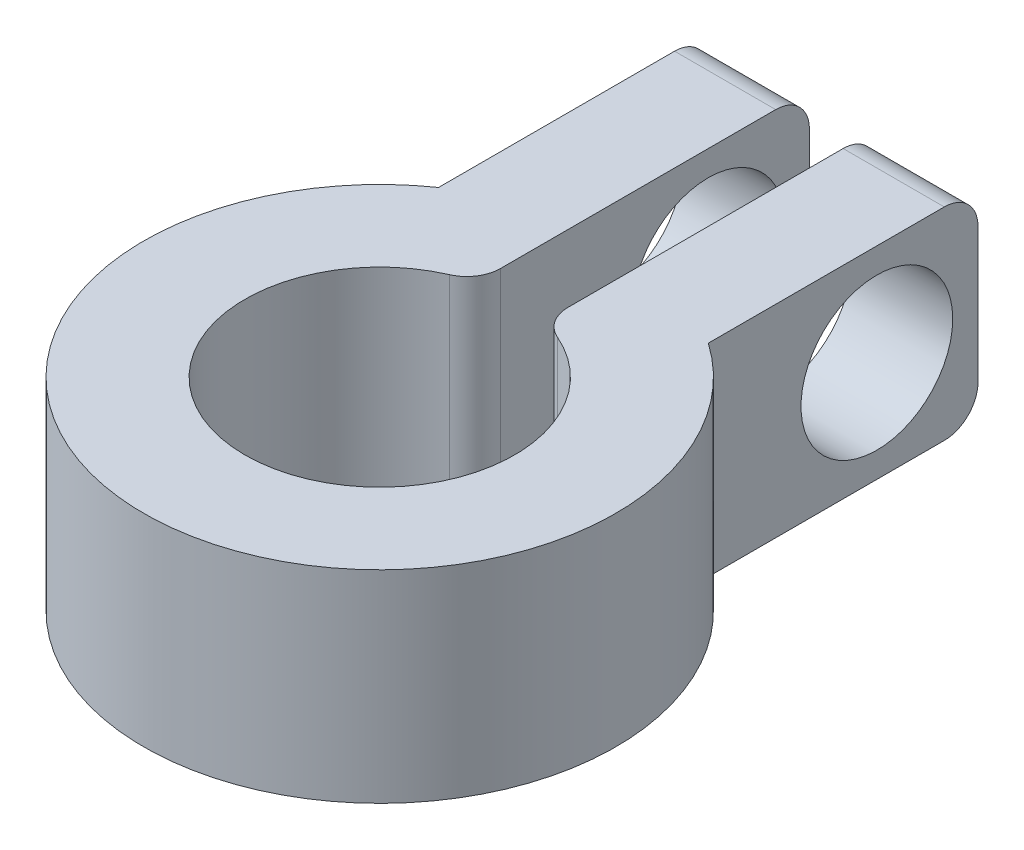
ISO-10303-21;
HEADER;
FILE_DESCRIPTION(('STEP AP214'),'2;1');
FILE_NAME('part.step','',(''),(''),'','','');
FILE_SCHEMA(('AUTOMOTIVE_DESIGN { 1 0 10303 214 1 1 1 1 }'));
ENDSEC;
DATA;
#1=APPLICATION_CONTEXT('core data for automotive mechanical design processes');
#2=APPLICATION_PROTOCOL_DEFINITION('international standard','automotive_design',2000,#1);
#3=PRODUCT_CONTEXT('',#1,'mechanical');
#4=PRODUCT('Part','Part','',(#3));
#5=PRODUCT_RELATED_PRODUCT_CATEGORY('part','',(#4));
#6=PRODUCT_DEFINITION_FORMATION('','',#4);
#7=PRODUCT_DEFINITION_CONTEXT('part definition',#1,'design');
#8=PRODUCT_DEFINITION('design','',#6,#7);
#9=PRODUCT_DEFINITION_SHAPE('','',#8);
#10=(LENGTH_UNIT() NAMED_UNIT(*) SI_UNIT(.MILLI.,.METRE.));
#11=(NAMED_UNIT(*) PLANE_ANGLE_UNIT() SI_UNIT($,.RADIAN.));
#12=(NAMED_UNIT(*) SI_UNIT($,.STERADIAN.) SOLID_ANGLE_UNIT());
#13=UNCERTAINTY_MEASURE_WITH_UNIT(LENGTH_MEASURE(1.E-05),#10,'distance_accuracy_value','');
#14=(GEOMETRIC_REPRESENTATION_CONTEXT(3) GLOBAL_UNCERTAINTY_ASSIGNED_CONTEXT((#13)) GLOBAL_UNIT_ASSIGNED_CONTEXT((#10,
#11,#12)) REPRESENTATION_CONTEXT('',''));
#15=CARTESIAN_POINT('',(0.,0.,0.));
#16=DIRECTION('',(0.,0.,1.));
#17=DIRECTION('',(1.,0.,0.));
#18=AXIS2_PLACEMENT_3D('',#15,#16,#17);
#19=CARTESIAN_POINT('',(0.,6.,0.));
#20=DIRECTION('',(0.,-1.,0.));
#21=DIRECTION('',(0.,0.,-1.));
#22=AXIS2_PLACEMENT_3D('',#19,#20,#21);
#23=CYLINDRICAL_SURFACE('',#22,4.);
#24=CARTESIAN_POINT('',(0.,6.,0.));
#25=DIRECTION('',(0.,-1.,0.));
#26=DIRECTION('',(0.,0.,1.));
#27=AXIS2_PLACEMENT_3D('',#24,#25,#26);
#28=CIRCLE('',#27,4.);
#29=CARTESIAN_POINT('',(1.6,6.,-3.66606055596467));
#30=VERTEX_POINT('',#29);
#31=CARTESIAN_POINT('',(-1.6,6.,-3.66606055596467));
#32=VERTEX_POINT('',#31);
#33=EDGE_CURVE('E190',#30,#32,#28,.T.);
#34=ORIENTED_EDGE('',*,*,#33,.F.);
#35=DIRECTION('',(0.,-1.,0.));
#36=VECTOR('',#35,1.);
#37=CARTESIAN_POINT('',(1.6,6.,-3.66606055596467));
#38=LINE('',#37,#36);
#39=CARTESIAN_POINT('',(1.6,0.,-3.66606055596467));
#40=VERTEX_POINT('',#39);
#41=EDGE_CURVE('E208',#30,#40,#38,.T.);
#42=ORIENTED_EDGE('',*,*,#41,.T.);
#43=CARTESIAN_POINT('',(0.,0.,0.));
#44=DIRECTION('',(0.,-1.,0.));
#45=DIRECTION('',(0.,0.,1.));
#46=AXIS2_PLACEMENT_3D('',#43,#44,#45);
#47=CIRCLE('',#46,4.);
#48=CARTESIAN_POINT('',(-1.6,0.,-3.66606055596467));
#49=VERTEX_POINT('',#48);
#50=EDGE_CURVE('E175',#40,#49,#47,.T.);
#51=ORIENTED_EDGE('',*,*,#50,.T.);
#52=DIRECTION('',(0.,-1.,0.));
#53=VECTOR('',#52,1.);
#54=CARTESIAN_POINT('',(-1.6,6.,-3.66606055596467));
#55=LINE('',#54,#53);
#56=EDGE_CURVE('E201',#49,#32,#55,.F.);
#57=ORIENTED_EDGE('',*,*,#56,.T.);
#58=EDGE_LOOP('',(#34,#42,#51,#57));
#59=FACE_BOUND('',#58,.T.);
#60=ADVANCED_FACE('F39',(#59),#23,.F.);
#61=CARTESIAN_POINT('',(-1.,6.,-3.87298334620742));
#62=DIRECTION('',(-1.,0.,0.));
#63=DIRECTION('',(0.,0.,1.));
#64=AXIS2_PLACEMENT_3D('',#61,#62,#63);
#65=PLANE('',#64);
#66=CARTESIAN_POINT('',(-1.,3.,-10.744562646538));
#67=DIRECTION('',(-1.,0.,0.));
#68=DIRECTION('',(0.,0.,1.));
#69=AXIS2_PLACEMENT_3D('',#66,#67,#68);
#70=CIRCLE('',#69,2.25);
#71=CARTESIAN_POINT('',(-1.,3.,-8.49456264653803));
#72=VERTEX_POINT('',#71);
#73=EDGE_CURVE('E179',#72,#72,#70,.T.);
#74=ORIENTED_EDGE('',*,*,#73,.T.);
#75=EDGE_LOOP('',(#74));
#76=FACE_BOUND('',#75,.T.);
#77=DIRECTION('',(0.,0.,-1.));
#78=VECTOR('',#77,1.);
#79=CARTESIAN_POINT('',(-1.,6.,-3.87298334620742));
#80=LINE('',#79,#78);
#81=CARTESIAN_POINT('',(-1.,6.,-4.58257569495584));
#82=VERTEX_POINT('',#81);
#83=CARTESIAN_POINT('',(-1.,6.,-12.744562646538));
#84=VERTEX_POINT('',#83);
#85=EDGE_CURVE('E152',#82,#84,#80,.T.);
#86=ORIENTED_EDGE('',*,*,#85,.F.);
#87=DIRECTION('',(0.,-1.,0.));
#88=VECTOR('',#87,1.);
#89=CARTESIAN_POINT('',(-1.,6.,-4.58257569495584));
#90=LINE('',#89,#88);
#91=CARTESIAN_POINT('',(-1.,0.,-4.58257569495584));
#92=VERTEX_POINT('',#91);
#93=EDGE_CURVE('E237',#82,#92,#90,.T.);
#94=ORIENTED_EDGE('',*,*,#93,.T.);
#95=DIRECTION('',(0.,0.,-1.));
#96=VECTOR('',#95,1.);
#97=CARTESIAN_POINT('',(-1.,0.,-3.87298334620742));
#98=LINE('',#97,#96);
#99=CARTESIAN_POINT('',(-1.,0.,-12.744562646538));
#100=VERTEX_POINT('',#99);
#101=EDGE_CURVE('E178',#92,#100,#98,.T.);
#102=ORIENTED_EDGE('',*,*,#101,.T.);
#103=CARTESIAN_POINT('',(-1.,1.,-12.744562646538));
#104=DIRECTION('',(-1.,0.,0.));
#105=DIRECTION('',(0.,0.,1.));
#106=AXIS2_PLACEMENT_3D('',#103,#104,#105);
#107=CIRCLE('',#106,1.);
#108=CARTESIAN_POINT('',(-1.,1.,-13.744562646538));
#109=VERTEX_POINT('',#108);
#110=EDGE_CURVE('E233',#100,#109,#107,.F.);
#111=ORIENTED_EDGE('',*,*,#110,.T.);
#112=DIRECTION('',(0.,-1.,0.));
#113=VECTOR('',#112,1.);
#114=CARTESIAN_POINT('',(-1.,6.,-13.744562646538));
#115=LINE('',#114,#113);
#116=CARTESIAN_POINT('',(-1.,5.,-13.744562646538));
#117=VERTEX_POINT('',#116);
#118=EDGE_CURVE('E198',#117,#109,#115,.T.);
#119=ORIENTED_EDGE('',*,*,#118,.F.);
#120=CARTESIAN_POINT('',(-1.,5.,-12.744562646538));
#121=DIRECTION('',(-1.,0.,0.));
#122=DIRECTION('',(0.,0.,1.));
#123=AXIS2_PLACEMENT_3D('',#120,#121,#122);
#124=CIRCLE('',#123,1.);
#125=EDGE_CURVE('E235',#117,#84,#124,.F.);
#126=ORIENTED_EDGE('',*,*,#125,.T.);
#127=EDGE_LOOP('',(#86,#94,#102,#111,#119,#126));
#128=FACE_BOUND('',#127,.T.);
#129=ADVANCED_FACE('F301',(#76,#128),#65,.F.);
#130=CARTESIAN_POINT('',(-1.,6.,-13.744562646538));
#131=DIRECTION('',(0.,0.,1.));
#132=DIRECTION('',(1.,0.,0.));
#133=AXIS2_PLACEMENT_3D('',#130,#131,#132);
#134=PLANE('',#133);
#135=DIRECTION('',(0.,-1.,0.));
#136=VECTOR('',#135,1.);
#137=CARTESIAN_POINT('',(-4.,6.,-13.744562646538));
#138=LINE('',#137,#136);
#139=CARTESIAN_POINT('',(-4.,5.,-13.744562646538));
#140=VERTEX_POINT('',#139);
#141=CARTESIAN_POINT('',(-4.,1.,-13.744562646538));
#142=VERTEX_POINT('',#141);
#143=EDGE_CURVE('E161',#140,#142,#138,.T.);
#144=ORIENTED_EDGE('',*,*,#143,.F.);
#145=DIRECTION('',(-1.,0.,0.));
#146=VECTOR('',#145,1.);
#147=CARTESIAN_POINT('',(-1.,5.,-13.744562646538));
#148=LINE('',#147,#146);
#149=EDGE_CURVE('E247',#140,#117,#148,.F.);
#150=ORIENTED_EDGE('',*,*,#149,.T.);
#151=ORIENTED_EDGE('',*,*,#118,.T.);
#152=DIRECTION('',(-1.,0.,0.));
#153=VECTOR('',#152,1.);
#154=CARTESIAN_POINT('',(-1.,1.,-13.744562646538));
#155=LINE('',#154,#153);
#156=EDGE_CURVE('E244',#109,#142,#155,.T.);
#157=ORIENTED_EDGE('',*,*,#156,.T.);
#158=EDGE_LOOP('',(#144,#150,#151,#157));
#159=FACE_BOUND('',#158,.T.);
#160=ADVANCED_FACE('F307',(#159),#134,.F.);
#161=CARTESIAN_POINT('',(-4.,6.,-13.744562646538));
#162=DIRECTION('',(1.,0.,0.));
#163=DIRECTION('',(0.,0.,-1.));
#164=AXIS2_PLACEMENT_3D('',#161,#162,#163);
#165=PLANE('',#164);
#166=CARTESIAN_POINT('',(-4.,3.,-10.744562646538));
#167=DIRECTION('',(1.,0.,0.));
#168=DIRECTION('',(0.,0.,-1.));
#169=AXIS2_PLACEMENT_3D('',#166,#167,#168);
#170=CIRCLE('',#169,2.25);
#171=CARTESIAN_POINT('',(-4.,3.,-12.994562646538));
#172=VERTEX_POINT('',#171);
#173=EDGE_CURVE('E205',#172,#172,#170,.T.);
#174=ORIENTED_EDGE('',*,*,#173,.T.);
#175=EDGE_LOOP('',(#174));
#176=FACE_BOUND('',#175,.T.);
#177=DIRECTION('',(0.,0.,1.));
#178=VECTOR('',#177,1.);
#179=CARTESIAN_POINT('',(-4.,6.,-13.744562646538));
#180=LINE('',#179,#178);
#181=CARTESIAN_POINT('',(-4.,6.,-12.744562646538));
#182=VERTEX_POINT('',#181);
#183=CARTESIAN_POINT('',(-4.,6.,-5.74456264653803));
#184=VERTEX_POINT('',#183);
#185=EDGE_CURVE('E140',#182,#184,#180,.T.);
#186=ORIENTED_EDGE('',*,*,#185,.F.);
#187=CARTESIAN_POINT('',(-4.,5.,-12.744562646538));
#188=DIRECTION('',(1.,0.,0.));
#189=DIRECTION('',(0.,0.,-1.));
#190=AXIS2_PLACEMENT_3D('',#187,#188,#189);
#191=CIRCLE('',#190,1.);
#192=EDGE_CURVE('E242',#182,#140,#191,.F.);
#193=ORIENTED_EDGE('',*,*,#192,.T.);
#194=ORIENTED_EDGE('',*,*,#143,.T.);
#195=CARTESIAN_POINT('',(-4.,1.,-12.744562646538));
#196=DIRECTION('',(1.,0.,0.));
#197=DIRECTION('',(0.,0.,-1.));
#198=AXIS2_PLACEMENT_3D('',#195,#196,#197);
#199=CIRCLE('',#198,1.);
#200=CARTESIAN_POINT('',(-4.,0.,-12.744562646538));
#201=VERTEX_POINT('',#200);
#202=EDGE_CURVE('E240',#142,#201,#199,.F.);
#203=ORIENTED_EDGE('',*,*,#202,.T.);
#204=DIRECTION('',(0.,0.,1.));
#205=VECTOR('',#204,1.);
#206=CARTESIAN_POINT('',(-4.,0.,-13.744562646538));
#207=LINE('',#206,#205);
#208=CARTESIAN_POINT('',(-4.,0.,-5.74456264653803));
#209=VERTEX_POINT('',#208);
#210=EDGE_CURVE('E158',#201,#209,#207,.T.);
#211=ORIENTED_EDGE('',*,*,#210,.T.);
#212=DIRECTION('',(0.,-1.,0.));
#213=VECTOR('',#212,1.);
#214=CARTESIAN_POINT('',(-4.,6.,-5.74456264653803));
#215=LINE('',#214,#213);
#216=EDGE_CURVE('E155',#184,#209,#215,.T.);
#217=ORIENTED_EDGE('',*,*,#216,.F.);
#218=EDGE_LOOP('',(#186,#193,#194,#203,#211,#217));
#219=FACE_BOUND('',#218,.T.);
#220=ADVANCED_FACE('F156',(#176,#219),#165,.F.);
#221=CARTESIAN_POINT('',(0.,6.,0.));
#222=DIRECTION('',(0.,-1.,0.));
#223=DIRECTION('',(0.,0.,-1.));
#224=AXIS2_PLACEMENT_3D('',#221,#222,#223);
#225=CYLINDRICAL_SURFACE('',#224,7.);
#226=CARTESIAN_POINT('',(0.,0.,0.));
#227=DIRECTION('',(0.,1.,0.));
#228=DIRECTION('',(0.,0.,1.));
#229=AXIS2_PLACEMENT_3D('',#226,#227,#228);
#230=CIRCLE('',#229,7.);
#231=CARTESIAN_POINT('',(4.,0.,-5.74456264653803));
#232=VERTEX_POINT('',#231);
#233=EDGE_CURVE('E183',#209,#232,#230,.T.);
#234=ORIENTED_EDGE('',*,*,#233,.T.);
#235=DIRECTION('',(0.,-1.,0.));
#236=VECTOR('',#235,1.);
#237=CARTESIAN_POINT('',(4.,6.,-5.74456264653803));
#238=LINE('',#237,#236);
#239=CARTESIAN_POINT('',(4.,6.,-5.74456264653803));
#240=VERTEX_POINT('',#239);
#241=EDGE_CURVE('E162',#240,#232,#238,.T.);
#242=ORIENTED_EDGE('',*,*,#241,.F.);
#243=CARTESIAN_POINT('',(0.,6.,0.));
#244=DIRECTION('',(0.,1.,0.));
#245=DIRECTION('',(0.,0.,1.));
#246=AXIS2_PLACEMENT_3D('',#243,#244,#245);
#247=CIRCLE('',#246,7.);
#248=EDGE_CURVE('E146',#184,#240,#247,.T.);
#249=ORIENTED_EDGE('',*,*,#248,.F.);
#250=ORIENTED_EDGE('',*,*,#216,.T.);
#251=EDGE_LOOP('',(#234,#242,#249,#250));
#252=FACE_BOUND('',#251,.T.);
#253=ADVANCED_FACE('F164',(#252),#225,.T.);
#254=CARTESIAN_POINT('',(4.,6.,-13.744562646538));
#255=DIRECTION('',(-1.,0.,0.));
#256=DIRECTION('',(0.,0.,1.));
#257=AXIS2_PLACEMENT_3D('',#254,#255,#256);
#258=PLANE('',#257);
#259=CARTESIAN_POINT('',(4.,3.,-10.744562646538));
#260=DIRECTION('',(1.,0.,0.));
#261=DIRECTION('',(0.,0.,-1.));
#262=AXIS2_PLACEMENT_3D('',#259,#260,#261);
#263=CIRCLE('',#262,2.25);
#264=CARTESIAN_POINT('',(4.,3.,-12.994562646538));
#265=VERTEX_POINT('',#264);
#266=EDGE_CURVE('E206',#265,#265,#263,.T.);
#267=ORIENTED_EDGE('',*,*,#266,.F.);
#268=EDGE_LOOP('',(#267));
#269=FACE_BOUND('',#268,.T.);
#270=DIRECTION('',(0.,0.,-1.));
#271=VECTOR('',#270,1.);
#272=CARTESIAN_POINT('',(4.,0.,-13.744562646538));
#273=LINE('',#272,#271);
#274=CARTESIAN_POINT('',(4.,0.,-12.744562646538));
#275=VERTEX_POINT('',#274);
#276=EDGE_CURVE('E185',#232,#275,#273,.T.);
#277=ORIENTED_EDGE('',*,*,#276,.T.);
#278=CARTESIAN_POINT('',(4.,1.,-12.744562646538));
#279=DIRECTION('',(-1.,0.,0.));
#280=DIRECTION('',(0.,0.,1.));
#281=AXIS2_PLACEMENT_3D('',#278,#279,#280);
#282=CIRCLE('',#281,1.);
#283=CARTESIAN_POINT('',(4.,1.,-13.744562646538));
#284=VERTEX_POINT('',#283);
#285=EDGE_CURVE('E11',#275,#284,#282,.F.);
#286=ORIENTED_EDGE('',*,*,#285,.T.);
#287=DIRECTION('',(0.,-1.,0.));
#288=VECTOR('',#287,1.);
#289=CARTESIAN_POINT('',(4.,6.,-13.744562646538));
#290=LINE('',#289,#288);
#291=CARTESIAN_POINT('',(4.,5.,-13.744562646538));
#292=VERTEX_POINT('',#291);
#293=EDGE_CURVE('E193',#292,#284,#290,.T.);
#294=ORIENTED_EDGE('',*,*,#293,.F.);
#295=CARTESIAN_POINT('',(4.,5.,-12.744562646538));
#296=DIRECTION('',(-1.,0.,0.));
#297=DIRECTION('',(0.,0.,1.));
#298=AXIS2_PLACEMENT_3D('',#295,#296,#297);
#299=CIRCLE('',#298,1.);
#300=CARTESIAN_POINT('',(4.,6.,-12.744562646538));
#301=VERTEX_POINT('',#300);
#302=EDGE_CURVE('E47',#292,#301,#299,.F.);
#303=ORIENTED_EDGE('',*,*,#302,.T.);
#304=DIRECTION('',(0.,0.,-1.));
#305=VECTOR('',#304,1.);
#306=CARTESIAN_POINT('',(4.,6.,-13.744562646538));
#307=LINE('',#306,#305);
#308=EDGE_CURVE('E167',#240,#301,#307,.T.);
#309=ORIENTED_EDGE('',*,*,#308,.F.);
#310=ORIENTED_EDGE('',*,*,#241,.T.);
#311=EDGE_LOOP('',(#277,#286,#294,#303,#309,#310));
#312=FACE_BOUND('',#311,.T.);
#313=ADVANCED_FACE('F253',(#269,#312),#258,.F.);
#314=CARTESIAN_POINT('',(0.999999999999997,6.,-13.744562646538));
#315=DIRECTION('',(0.,0.,1.));
#316=DIRECTION('',(1.,0.,0.));
#317=AXIS2_PLACEMENT_3D('',#314,#315,#316);
#318=PLANE('',#317);
#319=ORIENTED_EDGE('',*,*,#293,.T.);
#320=DIRECTION('',(-1.,0.,0.));
#321=VECTOR('',#320,1.);
#322=CARTESIAN_POINT('',(0.999999999999997,1.,-13.744562646538));
#323=LINE('',#322,#321);
#324=CARTESIAN_POINT('',(0.999999999999997,1.,-13.744562646538));
#325=VERTEX_POINT('',#324);
#326=EDGE_CURVE('E250',#284,#325,#323,.T.);
#327=ORIENTED_EDGE('',*,*,#326,.T.);
#328=DIRECTION('',(0.,-1.,0.));
#329=VECTOR('',#328,1.);
#330=CARTESIAN_POINT('',(0.999999999999997,6.,-13.744562646538));
#331=LINE('',#330,#329);
#332=CARTESIAN_POINT('',(0.999999999999997,5.,-13.744562646538));
#333=VERTEX_POINT('',#332);
#334=EDGE_CURVE('E174',#333,#325,#331,.T.);
#335=ORIENTED_EDGE('',*,*,#334,.F.);
#336=DIRECTION('',(-1.,0.,0.));
#337=VECTOR('',#336,1.);
#338=CARTESIAN_POINT('',(4.,5.,-13.744562646538));
#339=LINE('',#338,#337);
#340=EDGE_CURVE('E59',#333,#292,#339,.F.);
#341=ORIENTED_EDGE('',*,*,#340,.T.);
#342=EDGE_LOOP('',(#319,#327,#335,#341));
#343=FACE_BOUND('',#342,.T.);
#344=ADVANCED_FACE('F259',(#343),#318,.F.);
#345=CARTESIAN_POINT('',(0.999999999999999,6.,-3.87298334620742));
#346=DIRECTION('',(1.,0.,0.));
#347=DIRECTION('',(0.,0.,-1.));
#348=AXIS2_PLACEMENT_3D('',#345,#346,#347);
#349=PLANE('',#348);
#350=CARTESIAN_POINT('',(0.999999999999997,3.,-10.744562646538));
#351=DIRECTION('',(1.,0.,0.));
#352=DIRECTION('',(0.,0.,-1.));
#353=AXIS2_PLACEMENT_3D('',#350,#351,#352);
#354=CIRCLE('',#353,2.25);
#355=CARTESIAN_POINT('',(0.999999999999997,3.,-12.994562646538));
#356=VERTEX_POINT('',#355);
#357=EDGE_CURVE('E202',#356,#356,#354,.T.);
#358=ORIENTED_EDGE('',*,*,#357,.T.);
#359=EDGE_LOOP('',(#358));
#360=FACE_BOUND('',#359,.T.);
#361=DIRECTION('',(0.,0.,1.));
#362=VECTOR('',#361,1.);
#363=CARTESIAN_POINT('',(0.999999999999999,0.,-3.87298334620742));
#364=LINE('',#363,#362);
#365=CARTESIAN_POINT('',(0.999999999999997,0.,-12.744562646538));
#366=VERTEX_POINT('',#365);
#367=CARTESIAN_POINT('',(0.999999999999999,0.,-4.58257569495584));
#368=VERTEX_POINT('',#367);
#369=EDGE_CURVE('E187',#366,#368,#364,.T.);
#370=ORIENTED_EDGE('',*,*,#369,.T.);
#371=DIRECTION('',(0.,-1.,0.));
#372=VECTOR('',#371,1.);
#373=CARTESIAN_POINT('',(0.999999999999999,6.,-4.58257569495584));
#374=LINE('',#373,#372);
#375=CARTESIAN_POINT('',(0.999999999999999,6.,-4.58257569495584));
#376=VERTEX_POINT('',#375);
#377=EDGE_CURVE('E223',#368,#376,#374,.F.);
#378=ORIENTED_EDGE('',*,*,#377,.T.);
#379=DIRECTION('',(0.,0.,1.));
#380=VECTOR('',#379,1.);
#381=CARTESIAN_POINT('',(0.999999999999999,6.,-3.87298334620742));
#382=LINE('',#381,#380);
#383=CARTESIAN_POINT('',(0.999999999999997,6.,-12.744562646538));
#384=VERTEX_POINT('',#383);
#385=EDGE_CURVE('E169',#384,#376,#382,.T.);
#386=ORIENTED_EDGE('',*,*,#385,.F.);
#387=CARTESIAN_POINT('',(0.999999999999997,5.,-12.744562646538));
#388=DIRECTION('',(1.,0.,0.));
#389=DIRECTION('',(0.,0.,-1.));
#390=AXIS2_PLACEMENT_3D('',#387,#388,#389);
#391=CIRCLE('',#390,1.);
#392=EDGE_CURVE('E219',#384,#333,#391,.F.);
#393=ORIENTED_EDGE('',*,*,#392,.T.);
#394=ORIENTED_EDGE('',*,*,#334,.T.);
#395=CARTESIAN_POINT('',(0.999999999999997,1.,-12.744562646538));
#396=DIRECTION('',(1.,0.,0.));
#397=DIRECTION('',(0.,0.,-1.));
#398=AXIS2_PLACEMENT_3D('',#395,#396,#397);
#399=CIRCLE('',#398,1.);
#400=EDGE_CURVE('E221',#325,#366,#399,.F.);
#401=ORIENTED_EDGE('',*,*,#400,.T.);
#402=EDGE_LOOP('',(#370,#378,#386,#393,#394,#401));
#403=FACE_BOUND('',#402,.T.);
#404=ADVANCED_FACE('F258',(#360,#403),#349,.F.);
#405=CARTESIAN_POINT('',(0.,6.,0.));
#406=DIRECTION('',(0.,1.,0.));
#407=DIRECTION('',(0.,0.,1.));
#408=AXIS2_PLACEMENT_3D('',#405,#406,#407);
#409=PLANE('',#408);
#410=ORIENTED_EDGE('',*,*,#385,.T.);
#411=CARTESIAN_POINT('',(2.,6.,-4.58257569495584));
#412=DIRECTION('',(0.,1.,0.));
#413=DIRECTION('',(0.,0.,1.));
#414=AXIS2_PLACEMENT_3D('',#411,#412,#413);
#415=CIRCLE('',#414,1.);
#416=EDGE_CURVE('E231',#376,#30,#415,.T.);
#417=ORIENTED_EDGE('',*,*,#416,.T.);
#418=ORIENTED_EDGE('',*,*,#33,.T.);
#419=CARTESIAN_POINT('',(-2.,6.,-4.58257569495584));
#420=DIRECTION('',(0.,1.,0.));
#421=DIRECTION('',(0.,0.,1.));
#422=AXIS2_PLACEMENT_3D('',#419,#420,#421);
#423=CIRCLE('',#422,1.);
#424=EDGE_CURVE('E229',#32,#82,#423,.T.);
#425=ORIENTED_EDGE('',*,*,#424,.T.);
#426=ORIENTED_EDGE('',*,*,#85,.T.);
#427=DIRECTION('',(-1.,0.,0.));
#428=VECTOR('',#427,1.);
#429=CARTESIAN_POINT('',(-4.,6.,-12.744562646538));
#430=LINE('',#429,#428);
#431=EDGE_CURVE('E150',#84,#182,#430,.T.);
#432=ORIENTED_EDGE('',*,*,#431,.T.);
#433=ORIENTED_EDGE('',*,*,#185,.T.);
#434=ORIENTED_EDGE('',*,*,#248,.T.);
#435=ORIENTED_EDGE('',*,*,#308,.T.);
#436=DIRECTION('',(-1.,0.,0.));
#437=VECTOR('',#436,1.);
#438=CARTESIAN_POINT('',(0.999999999999997,6.,-12.744562646538));
#439=LINE('',#438,#437);
#440=EDGE_CURVE('E225',#301,#384,#439,.T.);
#441=ORIENTED_EDGE('',*,*,#440,.T.);
#442=EDGE_LOOP('',(#410,#417,#418,#425,#426,#432,#433,#434,#435,#441));
#443=FACE_BOUND('',#442,.T.);
#444=ADVANCED_FACE('F143',(#443),#409,.T.);
#445=CARTESIAN_POINT('',(0.,0.,0.));
#446=DIRECTION('',(0.,1.,0.));
#447=DIRECTION('',(0.,0.,1.));
#448=AXIS2_PLACEMENT_3D('',#445,#446,#447);
#449=PLANE('',#448);
#450=ORIENTED_EDGE('',*,*,#50,.F.);
#451=CARTESIAN_POINT('',(2.,0.,-4.58257569495584));
#452=DIRECTION('',(0.,1.,0.));
#453=DIRECTION('',(0.,0.,1.));
#454=AXIS2_PLACEMENT_3D('',#451,#452,#453);
#455=CIRCLE('',#454,1.);
#456=EDGE_CURVE('E217',#40,#368,#455,.F.);
#457=ORIENTED_EDGE('',*,*,#456,.T.);
#458=ORIENTED_EDGE('',*,*,#369,.F.);
#459=DIRECTION('',(-1.,0.,0.));
#460=VECTOR('',#459,1.);
#461=CARTESIAN_POINT('',(0.,0.,-12.744562646538));
#462=LINE('',#461,#460);
#463=EDGE_CURVE('E211',#366,#275,#462,.F.);
#464=ORIENTED_EDGE('',*,*,#463,.T.);
#465=ORIENTED_EDGE('',*,*,#276,.F.);
#466=ORIENTED_EDGE('',*,*,#233,.F.);
#467=ORIENTED_EDGE('',*,*,#210,.F.);
#468=DIRECTION('',(-1.,0.,0.));
#469=VECTOR('',#468,1.);
#470=CARTESIAN_POINT('',(0.,0.,-12.744562646538));
#471=LINE('',#470,#469);
#472=EDGE_CURVE('E213',#201,#100,#471,.F.);
#473=ORIENTED_EDGE('',*,*,#472,.T.);
#474=ORIENTED_EDGE('',*,*,#101,.F.);
#475=CARTESIAN_POINT('',(-2.,0.,-4.58257569495584));
#476=DIRECTION('',(0.,1.,0.));
#477=DIRECTION('',(0.,0.,1.));
#478=AXIS2_PLACEMENT_3D('',#475,#476,#477);
#479=CIRCLE('',#478,1.);
#480=EDGE_CURVE('E215',#92,#49,#479,.F.);
#481=ORIENTED_EDGE('',*,*,#480,.T.);
#482=EDGE_LOOP('',(#450,#457,#458,#464,#465,#466,#467,#473,#474,#481));
#483=FACE_BOUND('',#482,.T.);
#484=ADVANCED_FACE('F268',(#483),#449,.F.);
#485=CARTESIAN_POINT('',(-6.,3.,-10.744562646538));
#486=DIRECTION('',(1.,0.,0.));
#487=DIRECTION('',(0.,0.,-1.));
#488=AXIS2_PLACEMENT_3D('',#485,#486,#487);
#489=CYLINDRICAL_SURFACE('',#488,2.25);
#490=ORIENTED_EDGE('',*,*,#266,.T.);
#491=EDGE_LOOP('',(#490));
#492=FACE_BOUND('',#491,.T.);
#493=ORIENTED_EDGE('',*,*,#357,.F.);
#494=EDGE_LOOP('',(#493));
#495=FACE_BOUND('',#494,.T.);
#496=ADVANCED_FACE('F288',(#492,#495),#489,.F.);
#497=ORIENTED_EDGE('',*,*,#173,.F.);
#498=EDGE_LOOP('',(#497));
#499=FACE_BOUND('',#498,.T.);
#500=ORIENTED_EDGE('',*,*,#73,.F.);
#501=EDGE_LOOP('',(#500));
#502=FACE_BOUND('',#501,.T.);
#503=ADVANCED_FACE('F315',(#499,#502),#489,.F.);
#504=CARTESIAN_POINT('',(2.,6.,-4.58257569495584));
#505=DIRECTION('',(0.,-1.,0.));
#506=DIRECTION('',(0.,0.,-1.));
#507=AXIS2_PLACEMENT_3D('',#504,#505,#506);
#508=CYLINDRICAL_SURFACE('',#507,1.);
#509=ORIENTED_EDGE('',*,*,#416,.F.);
#510=ORIENTED_EDGE('',*,*,#377,.F.);
#511=ORIENTED_EDGE('',*,*,#456,.F.);
#512=ORIENTED_EDGE('',*,*,#41,.F.);
#513=EDGE_LOOP('',(#509,#510,#511,#512));
#514=FACE_BOUND('',#513,.T.);
#515=ADVANCED_FACE('F273',(#514),#508,.T.);
#516=CARTESIAN_POINT('',(-2.,6.,-4.58257569495584));
#517=DIRECTION('',(0.,-1.,0.));
#518=DIRECTION('',(0.,0.,-1.));
#519=AXIS2_PLACEMENT_3D('',#516,#517,#518);
#520=CYLINDRICAL_SURFACE('',#519,1.);
#521=ORIENTED_EDGE('',*,*,#424,.F.);
#522=ORIENTED_EDGE('',*,*,#56,.F.);
#523=ORIENTED_EDGE('',*,*,#480,.F.);
#524=ORIENTED_EDGE('',*,*,#93,.F.);
#525=EDGE_LOOP('',(#521,#522,#523,#524));
#526=FACE_BOUND('',#525,.T.);
#527=ADVANCED_FACE('F314',(#526),#520,.T.);
#528=CARTESIAN_POINT('',(0.,5.,-12.744562646538));
#529=DIRECTION('',(1.,0.,0.));
#530=DIRECTION('',(0.,0.,-1.));
#531=AXIS2_PLACEMENT_3D('',#528,#529,#530);
#532=CYLINDRICAL_SURFACE('',#531,1.);
#533=ORIENTED_EDGE('',*,*,#125,.F.);
#534=ORIENTED_EDGE('',*,*,#149,.F.);
#535=ORIENTED_EDGE('',*,*,#192,.F.);
#536=ORIENTED_EDGE('',*,*,#431,.F.);
#537=EDGE_LOOP('',(#533,#534,#535,#536));
#538=FACE_BOUND('',#537,.T.);
#539=ADVANCED_FACE('F318',(#538),#532,.T.);
#540=CARTESIAN_POINT('',(-1.,1.,-12.744562646538));
#541=DIRECTION('',(-1.,0.,0.));
#542=DIRECTION('',(0.,0.,1.));
#543=AXIS2_PLACEMENT_3D('',#540,#541,#542);
#544=CYLINDRICAL_SURFACE('',#543,1.);
#545=ORIENTED_EDGE('',*,*,#110,.F.);
#546=ORIENTED_EDGE('',*,*,#472,.F.);
#547=ORIENTED_EDGE('',*,*,#202,.F.);
#548=ORIENTED_EDGE('',*,*,#156,.F.);
#549=EDGE_LOOP('',(#545,#546,#547,#548));
#550=FACE_BOUND('',#549,.T.);
#551=ADVANCED_FACE('F322',(#550),#544,.T.);
#552=CARTESIAN_POINT('',(0.999999999999997,1.,-12.744562646538));
#553=DIRECTION('',(-1.,0.,0.));
#554=DIRECTION('',(0.,0.,1.));
#555=AXIS2_PLACEMENT_3D('',#552,#553,#554);
#556=CYLINDRICAL_SURFACE('',#555,1.);
#557=ORIENTED_EDGE('',*,*,#285,.F.);
#558=ORIENTED_EDGE('',*,*,#463,.F.);
#559=ORIENTED_EDGE('',*,*,#400,.F.);
#560=ORIENTED_EDGE('',*,*,#326,.F.);
#561=EDGE_LOOP('',(#557,#558,#559,#560));
#562=FACE_BOUND('',#561,.T.);
#563=ADVANCED_FACE('F262',(#562),#556,.T.);
#564=CARTESIAN_POINT('',(0.,5.,-12.744562646538));
#565=DIRECTION('',(1.,0.,0.));
#566=DIRECTION('',(0.,0.,-1.));
#567=AXIS2_PLACEMENT_3D('',#564,#565,#566);
#568=CYLINDRICAL_SURFACE('',#567,1.);
#569=ORIENTED_EDGE('',*,*,#302,.F.);
#570=ORIENTED_EDGE('',*,*,#340,.F.);
#571=ORIENTED_EDGE('',*,*,#392,.F.);
#572=ORIENTED_EDGE('',*,*,#440,.F.);
#573=EDGE_LOOP('',(#569,#570,#571,#572));
#574=FACE_BOUND('',#573,.T.);
#575=ADVANCED_FACE('F41',(#574),#568,.T.);
#576=CLOSED_SHELL('',(#60,#129,#160,#220,#253,#313,#344,#404,#444,#484,#496,#503,#515,#527,#539,
#551,#563,#575));
#577=MANIFOLD_SOLID_BREP('B2',#576);
#578=ADVANCED_BREP_SHAPE_REPRESENTATION('',(#18,#577),#14);
#579=SHAPE_DEFINITION_REPRESENTATION(#9,#578);
ENDSEC;
END-ISO-10303-21;
